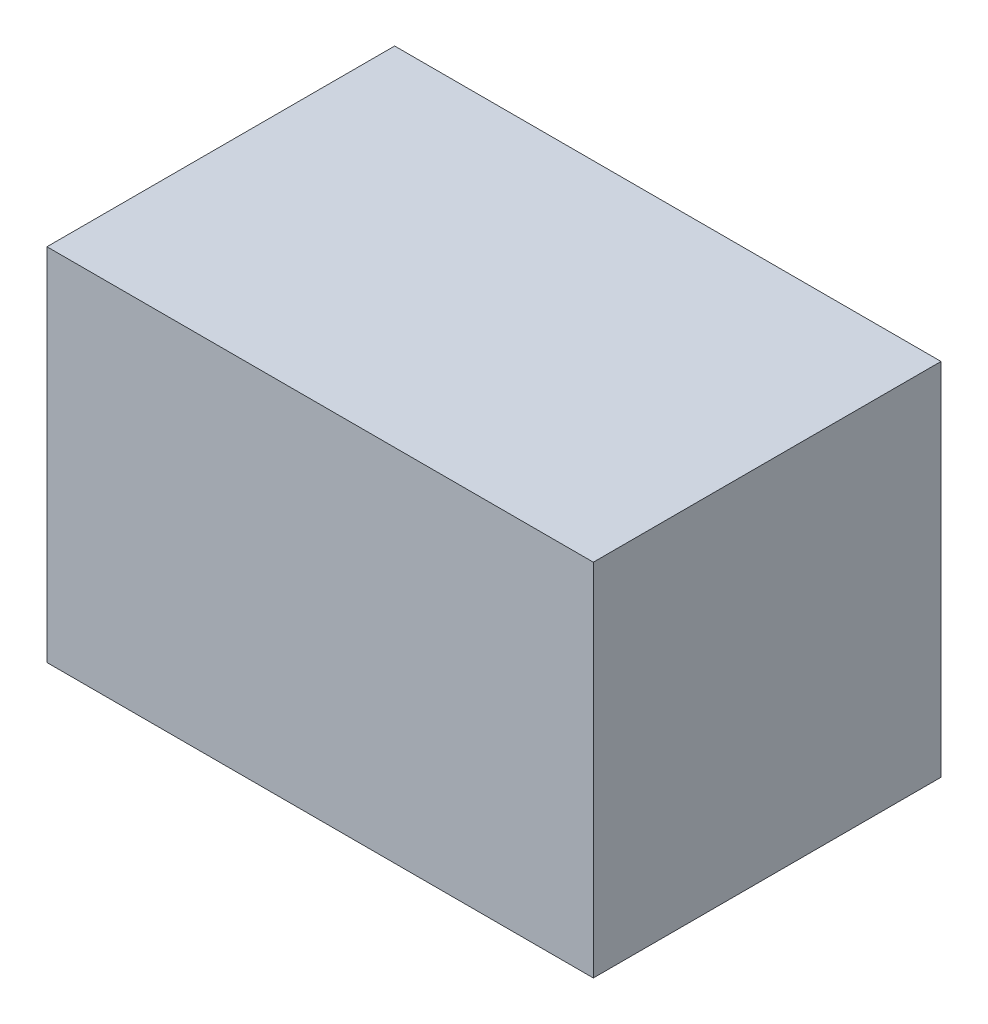
ISO-10303-21;
HEADER;
FILE_DESCRIPTION(('STEP AP214'),'2;1');
FILE_NAME('part.step','',(''),(''),'','','');
FILE_SCHEMA(('AUTOMOTIVE_DESIGN { 1 0 10303 214 1 1 1 1 }'));
ENDSEC;
DATA;
#1=APPLICATION_CONTEXT('core data for automotive mechanical design processes');
#2=APPLICATION_PROTOCOL_DEFINITION('international standard','automotive_design',2000,#1);
#3=PRODUCT_CONTEXT('',#1,'mechanical');
#4=PRODUCT('Part','Part','',(#3));
#5=PRODUCT_RELATED_PRODUCT_CATEGORY('part','',(#4));
#6=PRODUCT_DEFINITION_FORMATION('','',#4);
#7=PRODUCT_DEFINITION_CONTEXT('part definition',#1,'design');
#8=PRODUCT_DEFINITION('design','',#6,#7);
#9=PRODUCT_DEFINITION_SHAPE('','',#8);
#10=(LENGTH_UNIT() NAMED_UNIT(*) SI_UNIT(.MILLI.,.METRE.));
#11=(NAMED_UNIT(*) PLANE_ANGLE_UNIT() SI_UNIT($,.RADIAN.));
#12=(NAMED_UNIT(*) SI_UNIT($,.STERADIAN.) SOLID_ANGLE_UNIT());
#13=UNCERTAINTY_MEASURE_WITH_UNIT(LENGTH_MEASURE(1.E-05),#10,'distance_accuracy_value','');
#14=(GEOMETRIC_REPRESENTATION_CONTEXT(3) GLOBAL_UNCERTAINTY_ASSIGNED_CONTEXT((#13)) GLOBAL_UNIT_ASSIGNED_CONTEXT((#10,
#11,#12)) REPRESENTATION_CONTEXT('',''));
#15=CARTESIAN_POINT('',(0.,0.,0.));
#16=DIRECTION('',(0.,0.,1.));
#17=DIRECTION('',(1.,0.,0.));
#18=AXIS2_PLACEMENT_3D('',#15,#16,#17);
#19=CARTESIAN_POINT('',(-1.10000034,-0.72499982,1.39999974));
#20=DIRECTION('',(0.,0.,-1.));
#21=DIRECTION('',(-1.,0.,0.));
#22=AXIS2_PLACEMENT_3D('',#19,#20,#21);
#23=PLANE('',#22);
#24=DIRECTION('',(0.,1.,0.));
#25=VECTOR('',#24,1.);
#26=CARTESIAN_POINT('',(1.10000034,-0.72499982,1.39999974));
#27=LINE('',#26,#25);
#28=CARTESIAN_POINT('',(1.10000034,-0.72499982,1.39999974));
#29=VERTEX_POINT('',#28);
#30=CARTESIAN_POINT('',(1.10000034,0.72499982,1.39999974));
#31=VERTEX_POINT('',#30);
#32=EDGE_CURVE('E54',#29,#31,#27,.T.);
#33=ORIENTED_EDGE('',*,*,#32,.T.);
#34=DIRECTION('',(1.,0.,0.));
#35=VECTOR('',#34,1.);
#36=CARTESIAN_POINT('',(1.10000034,0.72499982,1.39999974));
#37=LINE('',#36,#35);
#38=CARTESIAN_POINT('',(-1.10000034,0.72499982,1.39999974));
#39=VERTEX_POINT('',#38);
#40=EDGE_CURVE('E56',#31,#39,#37,.F.);
#41=ORIENTED_EDGE('',*,*,#40,.T.);
#42=DIRECTION('',(0.,1.,0.));
#43=VECTOR('',#42,1.);
#44=CARTESIAN_POINT('',(-1.10000034,0.72499982,1.39999974));
#45=LINE('',#44,#43);
#46=CARTESIAN_POINT('',(-1.10000034,-0.72499982,1.39999974));
#47=VERTEX_POINT('',#46);
#48=EDGE_CURVE('E19',#39,#47,#45,.F.);
#49=ORIENTED_EDGE('',*,*,#48,.T.);
#50=DIRECTION('',(1.,0.,0.));
#51=VECTOR('',#50,1.);
#52=CARTESIAN_POINT('',(-1.10000034,-0.72499982,1.39999974));
#53=LINE('',#52,#51);
#54=EDGE_CURVE('E79',#47,#29,#53,.T.);
#55=ORIENTED_EDGE('',*,*,#54,.T.);
#56=EDGE_LOOP('',(#33,#41,#49,#55));
#57=FACE_BOUND('',#56,.T.);
#58=ADVANCED_FACE('F16',(#57),#23,.F.);
#59=CARTESIAN_POINT('',(-1.10000034,0.72499982,0.));
#60=DIRECTION('',(1.,0.,0.));
#61=DIRECTION('',(0.,0.,-1.));
#62=AXIS2_PLACEMENT_3D('',#59,#60,#61);
#63=PLANE('',#62);
#64=DIRECTION('',(0.,0.,1.));
#65=VECTOR('',#64,1.);
#66=CARTESIAN_POINT('',(-1.10000034,-0.72499982,0.));
#67=LINE('',#66,#65);
#68=CARTESIAN_POINT('',(-1.10000034,-0.72499982,0.));
#69=VERTEX_POINT('',#68);
#70=EDGE_CURVE('E67',#69,#47,#67,.T.);
#71=ORIENTED_EDGE('',*,*,#70,.T.);
#72=ORIENTED_EDGE('',*,*,#48,.F.);
#73=DIRECTION('',(0.,0.,-1.));
#74=VECTOR('',#73,1.);
#75=CARTESIAN_POINT('',(-1.10000034,0.72499982,0.));
#76=LINE('',#75,#74);
#77=CARTESIAN_POINT('',(-1.10000034,0.72499982,0.));
#78=VERTEX_POINT('',#77);
#79=EDGE_CURVE('E62',#39,#78,#76,.T.);
#80=ORIENTED_EDGE('',*,*,#79,.T.);
#81=DIRECTION('',(0.,1.,0.));
#82=VECTOR('',#81,1.);
#83=CARTESIAN_POINT('',(-1.10000034,-0.72499982,0.));
#84=LINE('',#83,#82);
#85=EDGE_CURVE('E82',#69,#78,#84,.T.);
#86=ORIENTED_EDGE('',*,*,#85,.F.);
#87=EDGE_LOOP('',(#71,#72,#80,#86));
#88=FACE_BOUND('',#87,.T.);
#89=ADVANCED_FACE('F64',(#88),#63,.F.);
#90=CARTESIAN_POINT('',(1.10000034,0.72499982,0.));
#91=DIRECTION('',(0.,-1.,0.));
#92=DIRECTION('',(0.,0.,-1.));
#93=AXIS2_PLACEMENT_3D('',#90,#91,#92);
#94=PLANE('',#93);
#95=ORIENTED_EDGE('',*,*,#79,.F.);
#96=ORIENTED_EDGE('',*,*,#40,.F.);
#97=DIRECTION('',(0.,0.,1.));
#98=VECTOR('',#97,1.);
#99=CARTESIAN_POINT('',(1.10000034,0.72499982,0.));
#100=LINE('',#99,#98);
#101=CARTESIAN_POINT('',(1.10000034,0.72499982,0.));
#102=VERTEX_POINT('',#101);
#103=EDGE_CURVE('E74',#31,#102,#100,.F.);
#104=ORIENTED_EDGE('',*,*,#103,.T.);
#105=DIRECTION('',(-1.,0.,0.));
#106=VECTOR('',#105,1.);
#107=CARTESIAN_POINT('',(-1.10000034,0.72499982,0.));
#108=LINE('',#107,#106);
#109=EDGE_CURVE('E71',#78,#102,#108,.F.);
#110=ORIENTED_EDGE('',*,*,#109,.F.);
#111=EDGE_LOOP('',(#95,#96,#104,#110));
#112=FACE_BOUND('',#111,.T.);
#113=ADVANCED_FACE('F69',(#112),#94,.F.);
#114=CARTESIAN_POINT('',(1.10000034,-0.72499982,0.));
#115=DIRECTION('',(-1.,0.,0.));
#116=DIRECTION('',(0.,0.,1.));
#117=AXIS2_PLACEMENT_3D('',#114,#115,#116);
#118=PLANE('',#117);
#119=ORIENTED_EDGE('',*,*,#103,.F.);
#120=ORIENTED_EDGE('',*,*,#32,.F.);
#121=DIRECTION('',(0.,0.,1.));
#122=VECTOR('',#121,1.);
#123=CARTESIAN_POINT('',(1.10000034,-0.72499982,0.));
#124=LINE('',#123,#122);
#125=CARTESIAN_POINT('',(1.10000034,-0.72499982,0.));
#126=VERTEX_POINT('',#125);
#127=EDGE_CURVE('E34',#29,#126,#124,.F.);
#128=ORIENTED_EDGE('',*,*,#127,.T.);
#129=DIRECTION('',(0.,1.,0.));
#130=VECTOR('',#129,1.);
#131=CARTESIAN_POINT('',(1.10000034,-0.72499982,0.));
#132=LINE('',#131,#130);
#133=EDGE_CURVE('E25',#102,#126,#132,.F.);
#134=ORIENTED_EDGE('',*,*,#133,.F.);
#135=EDGE_LOOP('',(#119,#120,#128,#134));
#136=FACE_BOUND('',#135,.T.);
#137=ADVANCED_FACE('F88',(#136),#118,.F.);
#138=CARTESIAN_POINT('',(-1.10000034,-0.72499982,0.));
#139=DIRECTION('',(0.,1.,0.));
#140=DIRECTION('',(0.,0.,1.));
#141=AXIS2_PLACEMENT_3D('',#138,#139,#140);
#142=PLANE('',#141);
#143=ORIENTED_EDGE('',*,*,#127,.F.);
#144=ORIENTED_EDGE('',*,*,#54,.F.);
#145=ORIENTED_EDGE('',*,*,#70,.F.);
#146=DIRECTION('',(-1.,0.,0.));
#147=VECTOR('',#146,1.);
#148=CARTESIAN_POINT('',(-1.10000034,-0.72499982,0.));
#149=LINE('',#148,#147);
#150=EDGE_CURVE('E11',#126,#69,#149,.T.);
#151=ORIENTED_EDGE('',*,*,#150,.F.);
#152=EDGE_LOOP('',(#143,#144,#145,#151));
#153=FACE_BOUND('',#152,.T.);
#154=ADVANCED_FACE('F90',(#153),#142,.F.);
#155=CARTESIAN_POINT('',(-1.10000034,-0.72499982,0.));
#156=DIRECTION('',(0.,0.,-1.));
#157=DIRECTION('',(-1.,0.,0.));
#158=AXIS2_PLACEMENT_3D('',#155,#156,#157);
#159=PLANE('',#158);
#160=ORIENTED_EDGE('',*,*,#133,.T.);
#161=ORIENTED_EDGE('',*,*,#150,.T.);
#162=ORIENTED_EDGE('',*,*,#85,.T.);
#163=ORIENTED_EDGE('',*,*,#109,.T.);
#164=EDGE_LOOP('',(#160,#161,#162,#163));
#165=FACE_BOUND('',#164,.T.);
#166=ADVANCED_FACE('F87',(#165),#159,.T.);
#167=CLOSED_SHELL('',(#58,#89,#113,#137,#154,#166));
#168=MANIFOLD_SOLID_BREP('B1',#167);
#169=ADVANCED_BREP_SHAPE_REPRESENTATION('',(#18,#168),#14);
#170=SHAPE_DEFINITION_REPRESENTATION(#9,#169);
ENDSEC;
END-ISO-10303-21;
